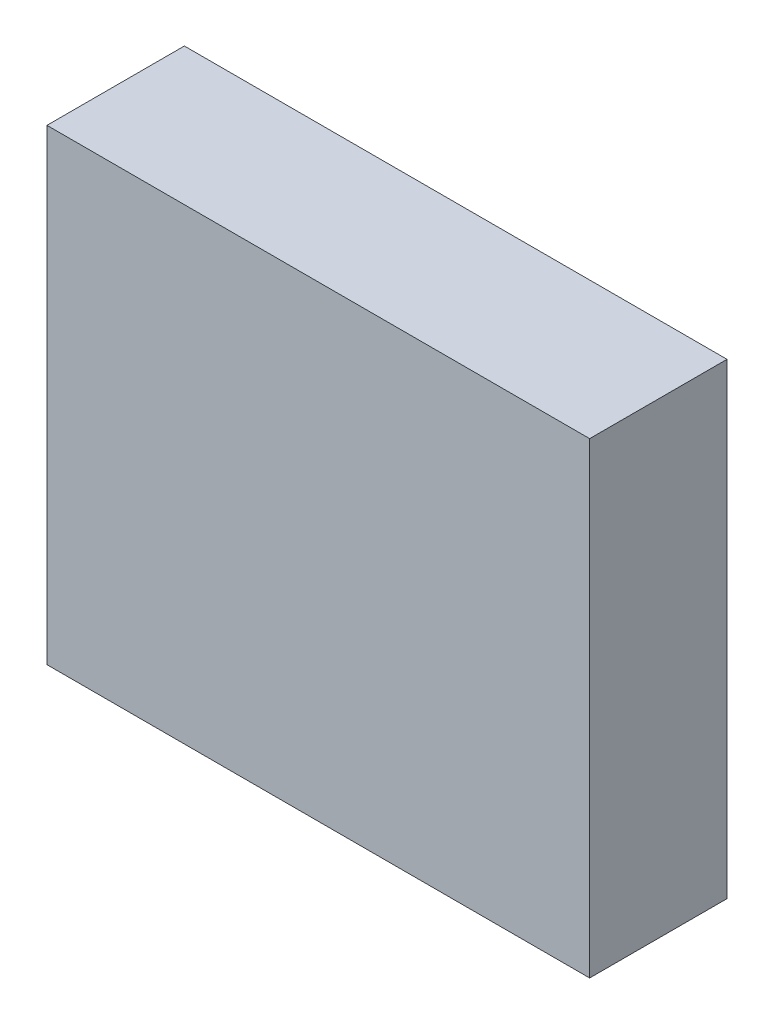
ISO-10303-21;
HEADER;
FILE_DESCRIPTION(('STEP AP214'),'2;1');
FILE_NAME('part.step','',(''),(''),'','','');
FILE_SCHEMA(('AUTOMOTIVE_DESIGN { 1 0 10303 214 1 1 1 1 }'));
ENDSEC;
DATA;
#1=APPLICATION_CONTEXT('core data for automotive mechanical design processes');
#2=APPLICATION_PROTOCOL_DEFINITION('international standard','automotive_design',2000,#1);
#3=PRODUCT_CONTEXT('',#1,'mechanical');
#4=PRODUCT('Part','Part','',(#3));
#5=PRODUCT_RELATED_PRODUCT_CATEGORY('part','',(#4));
#6=PRODUCT_DEFINITION_FORMATION('','',#4);
#7=PRODUCT_DEFINITION_CONTEXT('part definition',#1,'design');
#8=PRODUCT_DEFINITION('design','',#6,#7);
#9=PRODUCT_DEFINITION_SHAPE('','',#8);
#10=(LENGTH_UNIT() NAMED_UNIT(*) SI_UNIT(.MILLI.,.METRE.));
#11=(NAMED_UNIT(*) PLANE_ANGLE_UNIT() SI_UNIT($,.RADIAN.));
#12=(NAMED_UNIT(*) SI_UNIT($,.STERADIAN.) SOLID_ANGLE_UNIT());
#13=UNCERTAINTY_MEASURE_WITH_UNIT(LENGTH_MEASURE(1.E-05),#10,'distance_accuracy_value','');
#14=(GEOMETRIC_REPRESENTATION_CONTEXT(3) GLOBAL_UNCERTAINTY_ASSIGNED_CONTEXT((#13)) GLOBAL_UNIT_ASSIGNED_CONTEXT((#10,
#11,#12)) REPRESENTATION_CONTEXT('',''));
#15=CARTESIAN_POINT('',(0.,0.,0.));
#16=DIRECTION('',(0.,0.,1.));
#17=DIRECTION('',(1.,0.,0.));
#18=AXIS2_PLACEMENT_3D('',#15,#16,#17);
#19=CARTESIAN_POINT('',(39.5,-34.,20.));
#20=DIRECTION('',(-1.,0.,0.));
#21=DIRECTION('',(0.,0.,1.));
#22=AXIS2_PLACEMENT_3D('',#19,#20,#21);
#23=PLANE('',#22);
#24=DIRECTION('',(0.,1.,0.));
#25=VECTOR('',#24,1.);
#26=CARTESIAN_POINT('',(39.5,-34.,0.));
#27=LINE('',#26,#25);
#28=CARTESIAN_POINT('',(39.5,-34.,0.));
#29=VERTEX_POINT('',#28);
#30=CARTESIAN_POINT('',(39.5,34.,0.));
#31=VERTEX_POINT('',#30);
#32=EDGE_CURVE('E144',#29,#31,#27,.T.);
#33=ORIENTED_EDGE('',*,*,#32,.T.);
#34=DIRECTION('',(0.,0.,-1.));
#35=VECTOR('',#34,1.);
#36=CARTESIAN_POINT('',(39.5,34.,20.));
#37=LINE('',#36,#35);
#38=CARTESIAN_POINT('',(39.5,34.,20.));
#39=VERTEX_POINT('',#38);
#40=EDGE_CURVE('E11',#39,#31,#37,.T.);
#41=ORIENTED_EDGE('',*,*,#40,.F.);
#42=DIRECTION('',(0.,1.,0.));
#43=VECTOR('',#42,1.);
#44=CARTESIAN_POINT('',(39.5,-34.,20.));
#45=LINE('',#44,#43);
#46=CARTESIAN_POINT('',(39.5,-34.,20.));
#47=VERTEX_POINT('',#46);
#48=EDGE_CURVE('E148',#47,#39,#45,.T.);
#49=ORIENTED_EDGE('',*,*,#48,.F.);
#50=DIRECTION('',(0.,0.,-1.));
#51=VECTOR('',#50,1.);
#52=CARTESIAN_POINT('',(39.5,-34.,20.));
#53=LINE('',#52,#51);
#54=EDGE_CURVE('E154',#47,#29,#53,.T.);
#55=ORIENTED_EDGE('',*,*,#54,.T.);
#56=EDGE_LOOP('',(#33,#41,#49,#55));
#57=FACE_BOUND('',#56,.T.);
#58=ADVANCED_FACE('F33',(#57),#23,.F.);
#59=CARTESIAN_POINT('',(-39.5,34.,20.));
#60=DIRECTION('',(0.,-1.,0.));
#61=DIRECTION('',(0.,0.,-1.));
#62=AXIS2_PLACEMENT_3D('',#59,#60,#61);
#63=PLANE('',#62);
#64=DIRECTION('',(-1.,0.,0.));
#65=VECTOR('',#64,1.);
#66=CARTESIAN_POINT('',(-39.5,34.,0.));
#67=LINE('',#66,#65);
#68=CARTESIAN_POINT('',(-39.5,34.,0.));
#69=VERTEX_POINT('',#68);
#70=EDGE_CURVE('E157',#31,#69,#67,.T.);
#71=ORIENTED_EDGE('',*,*,#70,.T.);
#72=DIRECTION('',(0.,0.,-1.));
#73=VECTOR('',#72,1.);
#74=CARTESIAN_POINT('',(-39.5,34.,20.));
#75=LINE('',#74,#73);
#76=CARTESIAN_POINT('',(-39.5,34.,20.));
#77=VERTEX_POINT('',#76);
#78=EDGE_CURVE('E41',#77,#69,#75,.T.);
#79=ORIENTED_EDGE('',*,*,#78,.F.);
#80=DIRECTION('',(-1.,0.,0.));
#81=VECTOR('',#80,1.);
#82=CARTESIAN_POINT('',(-39.5,34.,20.));
#83=LINE('',#82,#81);
#84=EDGE_CURVE('E86',#39,#77,#83,.T.);
#85=ORIENTED_EDGE('',*,*,#84,.F.);
#86=ORIENTED_EDGE('',*,*,#40,.T.);
#87=EDGE_LOOP('',(#71,#79,#85,#86));
#88=FACE_BOUND('',#87,.T.);
#89=ADVANCED_FACE('F304',(#88),#63,.F.);
#90=CARTESIAN_POINT('',(-39.5,-34.,20.));
#91=DIRECTION('',(1.,0.,0.));
#92=DIRECTION('',(0.,0.,-1.));
#93=AXIS2_PLACEMENT_3D('',#90,#91,#92);
#94=PLANE('',#93);
#95=DIRECTION('',(0.,-1.,0.));
#96=VECTOR('',#95,1.);
#97=CARTESIAN_POINT('',(-39.5,-34.,0.));
#98=LINE('',#97,#96);
#99=CARTESIAN_POINT('',(-39.5,-34.,0.));
#100=VERTEX_POINT('',#99);
#101=EDGE_CURVE('E159',#69,#100,#98,.T.);
#102=ORIENTED_EDGE('',*,*,#101,.T.);
#103=DIRECTION('',(0.,0.,-1.));
#104=VECTOR('',#103,1.);
#105=CARTESIAN_POINT('',(-39.5,-34.,20.));
#106=LINE('',#105,#104);
#107=CARTESIAN_POINT('',(-39.5,-34.,20.));
#108=VERTEX_POINT('',#107);
#109=EDGE_CURVE('E163',#108,#100,#106,.T.);
#110=ORIENTED_EDGE('',*,*,#109,.F.);
#111=DIRECTION('',(0.,-1.,0.));
#112=VECTOR('',#111,1.);
#113=CARTESIAN_POINT('',(-39.5,-34.,20.));
#114=LINE('',#113,#112);
#115=EDGE_CURVE('E151',#77,#108,#114,.T.);
#116=ORIENTED_EDGE('',*,*,#115,.F.);
#117=ORIENTED_EDGE('',*,*,#78,.T.);
#118=EDGE_LOOP('',(#102,#110,#116,#117));
#119=FACE_BOUND('',#118,.T.);
#120=ADVANCED_FACE('F309',(#119),#94,.F.);
#121=CARTESIAN_POINT('',(-39.5,-34.,20.));
#122=DIRECTION('',(0.,1.,0.));
#123=DIRECTION('',(0.,0.,1.));
#124=AXIS2_PLACEMENT_3D('',#121,#122,#123);
#125=PLANE('',#124);
#126=DIRECTION('',(1.,0.,0.));
#127=VECTOR('',#126,1.);
#128=CARTESIAN_POINT('',(-39.5,-34.,0.));
#129=LINE('',#128,#127);
#130=EDGE_CURVE('E79',#100,#29,#129,.T.);
#131=ORIENTED_EDGE('',*,*,#130,.T.);
#132=ORIENTED_EDGE('',*,*,#54,.F.);
#133=DIRECTION('',(1.,0.,0.));
#134=VECTOR('',#133,1.);
#135=CARTESIAN_POINT('',(-39.5,-34.,20.));
#136=LINE('',#135,#134);
#137=EDGE_CURVE('E58',#108,#47,#136,.T.);
#138=ORIENTED_EDGE('',*,*,#137,.F.);
#139=ORIENTED_EDGE('',*,*,#109,.T.);
#140=EDGE_LOOP('',(#131,#132,#138,#139));
#141=FACE_BOUND('',#140,.T.);
#142=ADVANCED_FACE('F321',(#141),#125,.F.);
#143=CARTESIAN_POINT('',(0.,0.,20.));
#144=DIRECTION('',(0.,0.,-1.));
#145=DIRECTION('',(-1.,0.,0.));
#146=AXIS2_PLACEMENT_3D('',#143,#144,#145);
#147=PLANE('',#146);
#148=ORIENTED_EDGE('',*,*,#48,.T.);
#149=ORIENTED_EDGE('',*,*,#84,.T.);
#150=ORIENTED_EDGE('',*,*,#115,.T.);
#151=ORIENTED_EDGE('',*,*,#137,.T.);
#152=EDGE_LOOP('',(#148,#149,#150,#151));
#153=FACE_BOUND('',#152,.T.);
#154=ADVANCED_FACE('F319',(#153),#147,.F.);
#155=CARTESIAN_POINT('',(0.,0.,0.));
#156=DIRECTION('',(0.,0.,-1.));
#157=DIRECTION('',(-1.,0.,0.));
#158=AXIS2_PLACEMENT_3D('',#155,#156,#157);
#159=PLANE('',#158);
#160=DIRECTION('',(0.,1.,0.));
#161=VECTOR('',#160,1.);
#162=CARTESIAN_POINT('',(-34.5,-29.,0.));
#163=LINE('',#162,#161);
#164=CARTESIAN_POINT('',(-34.5,-29.,0.));
#165=VERTEX_POINT('',#164);
#166=CARTESIAN_POINT('',(-34.5,29.,0.));
#167=VERTEX_POINT('',#166);
#168=EDGE_CURVE('E49',#165,#167,#163,.T.);
#169=ORIENTED_EDGE('',*,*,#168,.F.);
#170=DIRECTION('',(-1.,0.,0.));
#171=VECTOR('',#170,1.);
#172=CARTESIAN_POINT('',(34.5,-29.,0.));
#173=LINE('',#172,#171);
#174=CARTESIAN_POINT('',(34.5,-29.,0.));
#175=VERTEX_POINT('',#174);
#176=EDGE_CURVE('E128',#175,#165,#173,.T.);
#177=ORIENTED_EDGE('',*,*,#176,.F.);
#178=DIRECTION('',(0.,-1.,0.));
#179=VECTOR('',#178,1.);
#180=CARTESIAN_POINT('',(34.5,-29.,0.));
#181=LINE('',#180,#179);
#182=CARTESIAN_POINT('',(34.5,29.,0.));
#183=VERTEX_POINT('',#182);
#184=EDGE_CURVE('E131',#183,#175,#181,.T.);
#185=ORIENTED_EDGE('',*,*,#184,.F.);
#186=DIRECTION('',(1.,0.,0.));
#187=VECTOR('',#186,1.);
#188=CARTESIAN_POINT('',(34.5,29.,0.));
#189=LINE('',#188,#187);
#190=EDGE_CURVE('E137',#167,#183,#189,.T.);
#191=ORIENTED_EDGE('',*,*,#190,.F.);
#192=EDGE_LOOP('',(#169,#177,#185,#191));
#193=FACE_BOUND('',#192,.T.);
#194=ORIENTED_EDGE('',*,*,#32,.F.);
#195=ORIENTED_EDGE('',*,*,#130,.F.);
#196=ORIENTED_EDGE('',*,*,#101,.F.);
#197=ORIENTED_EDGE('',*,*,#70,.F.);
#198=EDGE_LOOP('',(#194,#195,#196,#197));
#199=FACE_BOUND('',#198,.T.);
#200=ADVANCED_FACE('F314',(#193,#199),#159,.T.);
#201=CARTESIAN_POINT('',(-34.5,-29.,10.));
#202=DIRECTION('',(-1.,0.,0.));
#203=DIRECTION('',(0.,0.,1.));
#204=AXIS2_PLACEMENT_3D('',#201,#202,#203);
#205=PLANE('',#204);
#206=ORIENTED_EDGE('',*,*,#168,.T.);
#207=DIRECTION('',(0.,0.,-1.));
#208=VECTOR('',#207,1.);
#209=CARTESIAN_POINT('',(-34.5,29.,10.));
#210=LINE('',#209,#208);
#211=CARTESIAN_POINT('',(-34.5,29.,10.));
#212=VERTEX_POINT('',#211);
#213=EDGE_CURVE('E106',#212,#167,#210,.T.);
#214=ORIENTED_EDGE('',*,*,#213,.F.);
#215=DIRECTION('',(0.,1.,0.));
#216=VECTOR('',#215,1.);
#217=CARTESIAN_POINT('',(-34.5,-29.,10.));
#218=LINE('',#217,#216);
#219=CARTESIAN_POINT('',(-34.5,-29.,10.));
#220=VERTEX_POINT('',#219);
#221=EDGE_CURVE('E110',#220,#212,#218,.T.);
#222=ORIENTED_EDGE('',*,*,#221,.F.);
#223=DIRECTION('',(0.,0.,-1.));
#224=VECTOR('',#223,1.);
#225=CARTESIAN_POINT('',(-34.5,-29.,10.));
#226=LINE('',#225,#224);
#227=EDGE_CURVE('E142',#220,#165,#226,.T.);
#228=ORIENTED_EDGE('',*,*,#227,.T.);
#229=EDGE_LOOP('',(#206,#214,#222,#228));
#230=FACE_BOUND('',#229,.T.);
#231=ADVANCED_FACE('F108',(#230),#205,.F.);
#232=CARTESIAN_POINT('',(34.5,-29.,10.));
#233=DIRECTION('',(0.,-1.,0.));
#234=DIRECTION('',(1.,0.,0.));
#235=AXIS2_PLACEMENT_3D('',#232,#233,#234);
#236=PLANE('',#235);
#237=ORIENTED_EDGE('',*,*,#176,.T.);
#238=ORIENTED_EDGE('',*,*,#227,.F.);
#239=DIRECTION('',(-1.,0.,0.));
#240=VECTOR('',#239,1.);
#241=CARTESIAN_POINT('',(34.5,-29.,10.));
#242=LINE('',#241,#240);
#243=CARTESIAN_POINT('',(34.5,-29.,10.));
#244=VERTEX_POINT('',#243);
#245=EDGE_CURVE('E116',#244,#220,#242,.T.);
#246=ORIENTED_EDGE('',*,*,#245,.F.);
#247=DIRECTION('',(0.,0.,-1.));
#248=VECTOR('',#247,1.);
#249=CARTESIAN_POINT('',(34.5,-29.,10.));
#250=LINE('',#249,#248);
#251=EDGE_CURVE('E145',#244,#175,#250,.T.);
#252=ORIENTED_EDGE('',*,*,#251,.T.);
#253=EDGE_LOOP('',(#237,#238,#246,#252));
#254=FACE_BOUND('',#253,.T.);
#255=ADVANCED_FACE('F361',(#254),#236,.F.);
#256=CARTESIAN_POINT('',(34.5,-29.,10.));
#257=DIRECTION('',(1.,0.,0.));
#258=DIRECTION('',(0.,1.,0.));
#259=AXIS2_PLACEMENT_3D('',#256,#257,#258);
#260=PLANE('',#259);
#261=ORIENTED_EDGE('',*,*,#184,.T.);
#262=ORIENTED_EDGE('',*,*,#251,.F.);
#263=DIRECTION('',(0.,-1.,0.));
#264=VECTOR('',#263,1.);
#265=CARTESIAN_POINT('',(34.5,-29.,10.));
#266=LINE('',#265,#264);
#267=CARTESIAN_POINT('',(34.5,29.,10.));
#268=VERTEX_POINT('',#267);
#269=EDGE_CURVE('E124',#268,#244,#266,.T.);
#270=ORIENTED_EDGE('',*,*,#269,.F.);
#271=DIRECTION('',(0.,0.,-1.));
#272=VECTOR('',#271,1.);
#273=CARTESIAN_POINT('',(34.5,29.,10.));
#274=LINE('',#273,#272);
#275=EDGE_CURVE('E115',#268,#183,#274,.T.);
#276=ORIENTED_EDGE('',*,*,#275,.T.);
#277=EDGE_LOOP('',(#261,#262,#270,#276));
#278=FACE_BOUND('',#277,.T.);
#279=ADVANCED_FACE('F369',(#278),#260,.F.);
#280=CARTESIAN_POINT('',(34.5,29.,10.));
#281=DIRECTION('',(0.,1.,0.));
#282=DIRECTION('',(-1.,0.,0.));
#283=AXIS2_PLACEMENT_3D('',#280,#281,#282);
#284=PLANE('',#283);
#285=ORIENTED_EDGE('',*,*,#190,.T.);
#286=ORIENTED_EDGE('',*,*,#275,.F.);
#287=DIRECTION('',(1.,0.,0.));
#288=VECTOR('',#287,1.);
#289=CARTESIAN_POINT('',(34.5,29.,10.));
#290=LINE('',#289,#288);
#291=EDGE_CURVE('E119',#212,#268,#290,.T.);
#292=ORIENTED_EDGE('',*,*,#291,.F.);
#293=ORIENTED_EDGE('',*,*,#213,.T.);
#294=EDGE_LOOP('',(#285,#286,#292,#293));
#295=FACE_BOUND('',#294,.T.);
#296=ADVANCED_FACE('F120',(#295),#284,.F.);
#297=CARTESIAN_POINT('',(0.,0.,10.));
#298=DIRECTION('',(0.,0.,1.));
#299=DIRECTION('',(1.,0.,0.));
#300=AXIS2_PLACEMENT_3D('',#297,#298,#299);
#301=PLANE('',#300);
#302=CARTESIAN_POINT('',(20.,-20.,10.));
#303=DIRECTION('',(0.,0.,1.));
#304=DIRECTION('',(1.,0.,0.));
#305=AXIS2_PLACEMENT_3D('',#302,#303,#304);
#306=CIRCLE('',#305,2.5);
#307=CARTESIAN_POINT('',(22.5,-20.,10.));
#308=VERTEX_POINT('',#307);
#309=EDGE_CURVE('E36',#308,#308,#306,.F.);
#310=ORIENTED_EDGE('',*,*,#309,.F.);
#311=EDGE_LOOP('',(#310));
#312=FACE_BOUND('',#311,.T.);
#313=CARTESIAN_POINT('',(20.,-10.,10.));
#314=DIRECTION('',(0.,0.,1.));
#315=DIRECTION('',(1.,0.,0.));
#316=AXIS2_PLACEMENT_3D('',#313,#314,#315);
#317=CIRCLE('',#316,2.5);
#318=CARTESIAN_POINT('',(22.5,-10.,10.));
#319=VERTEX_POINT('',#318);
#320=EDGE_CURVE('E234',#319,#319,#317,.F.);
#321=ORIENTED_EDGE('',*,*,#320,.F.);
#322=EDGE_LOOP('',(#321));
#323=FACE_BOUND('',#322,.T.);
#324=CARTESIAN_POINT('',(20.,20.,10.));
#325=DIRECTION('',(0.,0.,1.));
#326=DIRECTION('',(1.,0.,0.));
#327=AXIS2_PLACEMENT_3D('',#324,#325,#326);
#328=CIRCLE('',#327,2.5);
#329=CARTESIAN_POINT('',(22.5,20.,10.));
#330=VERTEX_POINT('',#329);
#331=EDGE_CURVE('E232',#330,#330,#328,.F.);
#332=ORIENTED_EDGE('',*,*,#331,.F.);
#333=EDGE_LOOP('',(#332));
#334=FACE_BOUND('',#333,.T.);
#335=CARTESIAN_POINT('',(20.,10.,10.));
#336=DIRECTION('',(0.,0.,1.));
#337=DIRECTION('',(1.,0.,0.));
#338=AXIS2_PLACEMENT_3D('',#335,#336,#337);
#339=CIRCLE('',#338,2.5);
#340=CARTESIAN_POINT('',(22.5,10.,10.));
#341=VERTEX_POINT('',#340);
#342=EDGE_CURVE('E229',#341,#341,#339,.F.);
#343=ORIENTED_EDGE('',*,*,#342,.F.);
#344=EDGE_LOOP('',(#343));
#345=FACE_BOUND('',#344,.T.);
#346=CARTESIAN_POINT('',(20.,0.,10.));
#347=DIRECTION('',(0.,0.,1.));
#348=DIRECTION('',(1.,0.,0.));
#349=AXIS2_PLACEMENT_3D('',#346,#347,#348);
#350=CIRCLE('',#349,2.5);
#351=CARTESIAN_POINT('',(22.5,0.,10.));
#352=VERTEX_POINT('',#351);
#353=EDGE_CURVE('E226',#352,#352,#350,.F.);
#354=ORIENTED_EDGE('',*,*,#353,.F.);
#355=EDGE_LOOP('',(#354));
#356=FACE_BOUND('',#355,.T.);
#357=CARTESIAN_POINT('',(10.,-20.,10.));
#358=DIRECTION('',(0.,0.,1.));
#359=DIRECTION('',(1.,0.,0.));
#360=AXIS2_PLACEMENT_3D('',#357,#358,#359);
#361=CIRCLE('',#360,2.5);
#362=CARTESIAN_POINT('',(12.5,-20.,10.));
#363=VERTEX_POINT('',#362);
#364=EDGE_CURVE('E223',#363,#363,#361,.F.);
#365=ORIENTED_EDGE('',*,*,#364,.F.);
#366=EDGE_LOOP('',(#365));
#367=FACE_BOUND('',#366,.T.);
#368=CARTESIAN_POINT('',(10.,-10.,10.));
#369=DIRECTION('',(0.,0.,1.));
#370=DIRECTION('',(1.,0.,0.));
#371=AXIS2_PLACEMENT_3D('',#368,#369,#370);
#372=CIRCLE('',#371,2.5);
#373=CARTESIAN_POINT('',(12.5,-10.,10.));
#374=VERTEX_POINT('',#373);
#375=EDGE_CURVE('E220',#374,#374,#372,.F.);
#376=ORIENTED_EDGE('',*,*,#375,.F.);
#377=EDGE_LOOP('',(#376));
#378=FACE_BOUND('',#377,.T.);
#379=CARTESIAN_POINT('',(10.,20.,10.));
#380=DIRECTION('',(0.,0.,1.));
#381=DIRECTION('',(1.,0.,0.));
#382=AXIS2_PLACEMENT_3D('',#379,#380,#381);
#383=CIRCLE('',#382,2.5);
#384=CARTESIAN_POINT('',(12.5,20.,10.));
#385=VERTEX_POINT('',#384);
#386=EDGE_CURVE('E217',#385,#385,#383,.F.);
#387=ORIENTED_EDGE('',*,*,#386,.F.);
#388=EDGE_LOOP('',(#387));
#389=FACE_BOUND('',#388,.T.);
#390=CARTESIAN_POINT('',(10.,10.,10.));
#391=DIRECTION('',(0.,0.,1.));
#392=DIRECTION('',(1.,0.,0.));
#393=AXIS2_PLACEMENT_3D('',#390,#391,#392);
#394=CIRCLE('',#393,2.5);
#395=CARTESIAN_POINT('',(12.5,10.,10.));
#396=VERTEX_POINT('',#395);
#397=EDGE_CURVE('E214',#396,#396,#394,.F.);
#398=ORIENTED_EDGE('',*,*,#397,.F.);
#399=EDGE_LOOP('',(#398));
#400=FACE_BOUND('',#399,.T.);
#401=CARTESIAN_POINT('',(10.,0.,10.));
#402=DIRECTION('',(0.,0.,1.));
#403=DIRECTION('',(1.,0.,0.));
#404=AXIS2_PLACEMENT_3D('',#401,#402,#403);
#405=CIRCLE('',#404,2.5);
#406=CARTESIAN_POINT('',(12.5,0.,10.));
#407=VERTEX_POINT('',#406);
#408=EDGE_CURVE('E211',#407,#407,#405,.F.);
#409=ORIENTED_EDGE('',*,*,#408,.F.);
#410=EDGE_LOOP('',(#409));
#411=FACE_BOUND('',#410,.T.);
#412=CARTESIAN_POINT('',(-20.,-20.,10.));
#413=DIRECTION('',(0.,0.,1.));
#414=DIRECTION('',(1.,0.,0.));
#415=AXIS2_PLACEMENT_3D('',#412,#413,#414);
#416=CIRCLE('',#415,2.5);
#417=CARTESIAN_POINT('',(-17.5,-20.,10.));
#418=VERTEX_POINT('',#417);
#419=EDGE_CURVE('E208',#418,#418,#416,.F.);
#420=ORIENTED_EDGE('',*,*,#419,.F.);
#421=EDGE_LOOP('',(#420));
#422=FACE_BOUND('',#421,.T.);
#423=CARTESIAN_POINT('',(-10.,-20.,10.));
#424=DIRECTION('',(0.,0.,1.));
#425=DIRECTION('',(1.,0.,0.));
#426=AXIS2_PLACEMENT_3D('',#423,#424,#425);
#427=CIRCLE('',#426,2.5);
#428=CARTESIAN_POINT('',(-7.5,-20.,10.));
#429=VERTEX_POINT('',#428);
#430=EDGE_CURVE('E205',#429,#429,#427,.F.);
#431=ORIENTED_EDGE('',*,*,#430,.F.);
#432=EDGE_LOOP('',(#431));
#433=FACE_BOUND('',#432,.T.);
#434=CARTESIAN_POINT('',(0.,-20.,10.));
#435=DIRECTION('',(0.,0.,1.));
#436=DIRECTION('',(1.,0.,0.));
#437=AXIS2_PLACEMENT_3D('',#434,#435,#436);
#438=CIRCLE('',#437,2.5);
#439=CARTESIAN_POINT('',(2.5,-20.,10.));
#440=VERTEX_POINT('',#439);
#441=EDGE_CURVE('E202',#440,#440,#438,.F.);
#442=ORIENTED_EDGE('',*,*,#441,.F.);
#443=EDGE_LOOP('',(#442));
#444=FACE_BOUND('',#443,.T.);
#445=CARTESIAN_POINT('',(-20.,-10.,10.));
#446=DIRECTION('',(0.,0.,1.));
#447=DIRECTION('',(1.,0.,0.));
#448=AXIS2_PLACEMENT_3D('',#445,#446,#447);
#449=CIRCLE('',#448,2.5);
#450=CARTESIAN_POINT('',(-17.5,-10.,10.));
#451=VERTEX_POINT('',#450);
#452=EDGE_CURVE('E199',#451,#451,#449,.F.);
#453=ORIENTED_EDGE('',*,*,#452,.F.);
#454=EDGE_LOOP('',(#453));
#455=FACE_BOUND('',#454,.T.);
#456=CARTESIAN_POINT('',(-10.,-10.,10.));
#457=DIRECTION('',(0.,0.,1.));
#458=DIRECTION('',(1.,0.,0.));
#459=AXIS2_PLACEMENT_3D('',#456,#457,#458);
#460=CIRCLE('',#459,2.5);
#461=CARTESIAN_POINT('',(-7.5,-10.,10.));
#462=VERTEX_POINT('',#461);
#463=EDGE_CURVE('E196',#462,#462,#460,.F.);
#464=ORIENTED_EDGE('',*,*,#463,.F.);
#465=EDGE_LOOP('',(#464));
#466=FACE_BOUND('',#465,.T.);
#467=CARTESIAN_POINT('',(0.,-10.,10.));
#468=DIRECTION('',(0.,0.,1.));
#469=DIRECTION('',(1.,0.,0.));
#470=AXIS2_PLACEMENT_3D('',#467,#468,#469);
#471=CIRCLE('',#470,2.5);
#472=CARTESIAN_POINT('',(2.5,-10.,10.));
#473=VERTEX_POINT('',#472);
#474=EDGE_CURVE('E193',#473,#473,#471,.F.);
#475=ORIENTED_EDGE('',*,*,#474,.F.);
#476=EDGE_LOOP('',(#475));
#477=FACE_BOUND('',#476,.T.);
#478=CARTESIAN_POINT('',(-20.,20.,10.));
#479=DIRECTION('',(0.,0.,1.));
#480=DIRECTION('',(1.,0.,0.));
#481=AXIS2_PLACEMENT_3D('',#478,#479,#480);
#482=CIRCLE('',#481,2.5);
#483=CARTESIAN_POINT('',(-17.5,20.,10.));
#484=VERTEX_POINT('',#483);
#485=EDGE_CURVE('E190',#484,#484,#482,.F.);
#486=ORIENTED_EDGE('',*,*,#485,.F.);
#487=EDGE_LOOP('',(#486));
#488=FACE_BOUND('',#487,.T.);
#489=CARTESIAN_POINT('',(-10.,20.,10.));
#490=DIRECTION('',(0.,0.,1.));
#491=DIRECTION('',(1.,0.,0.));
#492=AXIS2_PLACEMENT_3D('',#489,#490,#491);
#493=CIRCLE('',#492,2.5);
#494=CARTESIAN_POINT('',(-7.5,20.,10.));
#495=VERTEX_POINT('',#494);
#496=EDGE_CURVE('E187',#495,#495,#493,.F.);
#497=ORIENTED_EDGE('',*,*,#496,.F.);
#498=EDGE_LOOP('',(#497));
#499=FACE_BOUND('',#498,.T.);
#500=CARTESIAN_POINT('',(0.,20.,10.));
#501=DIRECTION('',(0.,0.,1.));
#502=DIRECTION('',(1.,0.,0.));
#503=AXIS2_PLACEMENT_3D('',#500,#501,#502);
#504=CIRCLE('',#503,2.5);
#505=CARTESIAN_POINT('',(2.5,20.,10.));
#506=VERTEX_POINT('',#505);
#507=EDGE_CURVE('E184',#506,#506,#504,.F.);
#508=ORIENTED_EDGE('',*,*,#507,.F.);
#509=EDGE_LOOP('',(#508));
#510=FACE_BOUND('',#509,.T.);
#511=CARTESIAN_POINT('',(-20.,10.,10.));
#512=DIRECTION('',(0.,0.,1.));
#513=DIRECTION('',(1.,0.,0.));
#514=AXIS2_PLACEMENT_3D('',#511,#512,#513);
#515=CIRCLE('',#514,2.5);
#516=CARTESIAN_POINT('',(-17.5,10.,10.));
#517=VERTEX_POINT('',#516);
#518=EDGE_CURVE('E181',#517,#517,#515,.F.);
#519=ORIENTED_EDGE('',*,*,#518,.F.);
#520=EDGE_LOOP('',(#519));
#521=FACE_BOUND('',#520,.T.);
#522=CARTESIAN_POINT('',(-10.,10.,10.));
#523=DIRECTION('',(0.,0.,1.));
#524=DIRECTION('',(1.,0.,0.));
#525=AXIS2_PLACEMENT_3D('',#522,#523,#524);
#526=CIRCLE('',#525,2.5);
#527=CARTESIAN_POINT('',(-7.5,10.,10.));
#528=VERTEX_POINT('',#527);
#529=EDGE_CURVE('E178',#528,#528,#526,.F.);
#530=ORIENTED_EDGE('',*,*,#529,.F.);
#531=EDGE_LOOP('',(#530));
#532=FACE_BOUND('',#531,.T.);
#533=CARTESIAN_POINT('',(0.,10.,10.));
#534=DIRECTION('',(0.,0.,1.));
#535=DIRECTION('',(1.,0.,0.));
#536=AXIS2_PLACEMENT_3D('',#533,#534,#535);
#537=CIRCLE('',#536,2.5);
#538=CARTESIAN_POINT('',(2.5,10.,10.));
#539=VERTEX_POINT('',#538);
#540=EDGE_CURVE('E175',#539,#539,#537,.F.);
#541=ORIENTED_EDGE('',*,*,#540,.F.);
#542=EDGE_LOOP('',(#541));
#543=FACE_BOUND('',#542,.T.);
#544=CARTESIAN_POINT('',(-20.,0.,10.));
#545=DIRECTION('',(0.,0.,1.));
#546=DIRECTION('',(1.,0.,0.));
#547=AXIS2_PLACEMENT_3D('',#544,#545,#546);
#548=CIRCLE('',#547,2.5);
#549=CARTESIAN_POINT('',(-17.5,0.,10.));
#550=VERTEX_POINT('',#549);
#551=EDGE_CURVE('E172',#550,#550,#548,.F.);
#552=ORIENTED_EDGE('',*,*,#551,.F.);
#553=EDGE_LOOP('',(#552));
#554=FACE_BOUND('',#553,.T.);
#555=CARTESIAN_POINT('',(-10.,0.,10.));
#556=DIRECTION('',(0.,0.,1.));
#557=DIRECTION('',(1.,0.,0.));
#558=AXIS2_PLACEMENT_3D('',#555,#556,#557);
#559=CIRCLE('',#558,2.5);
#560=CARTESIAN_POINT('',(-7.5,0.,10.));
#561=VERTEX_POINT('',#560);
#562=EDGE_CURVE('E169',#561,#561,#559,.F.);
#563=ORIENTED_EDGE('',*,*,#562,.F.);
#564=EDGE_LOOP('',(#563));
#565=FACE_BOUND('',#564,.T.);
#566=CARTESIAN_POINT('',(0.,0.,10.));
#567=DIRECTION('',(0.,0.,1.));
#568=DIRECTION('',(1.,0.,0.));
#569=AXIS2_PLACEMENT_3D('',#566,#567,#568);
#570=CIRCLE('',#569,2.5);
#571=CARTESIAN_POINT('',(2.5,0.,10.));
#572=VERTEX_POINT('',#571);
#573=EDGE_CURVE('E138',#572,#572,#570,.F.);
#574=ORIENTED_EDGE('',*,*,#573,.F.);
#575=EDGE_LOOP('',(#574));
#576=FACE_BOUND('',#575,.T.);
#577=ORIENTED_EDGE('',*,*,#221,.T.);
#578=ORIENTED_EDGE('',*,*,#291,.T.);
#579=ORIENTED_EDGE('',*,*,#269,.T.);
#580=ORIENTED_EDGE('',*,*,#245,.T.);
#581=EDGE_LOOP('',(#577,#578,#579,#580));
#582=FACE_BOUND('',#581,.T.);
#583=ADVANCED_FACE('F126',(#312,#323,#334,#345,#356,#367,#378,#389,#400,#411,#422,#433,#444,
#455,#466,#477,#488,#499,#510,#521,#532,#543,#554,#565,#576,#582),#301,.F.);
#584=CARTESIAN_POINT('',(0.,0.,10.));
#585=DIRECTION('',(0.,1.,0.));
#586=DIRECTION('',(-1.,0.,0.));
#587=AXIS2_PLACEMENT_3D('',#584,#585,#586);
#588=SPHERICAL_SURFACE('',#587,2.5);
#589=CARTESIAN_POINT('',(0.,0.,10.));
#590=DIRECTION('',(0.,0.,1.));
#591=DIRECTION('',(1.,0.,0.));
#592=AXIS2_PLACEMENT_3D('',#589,#590,#591);
#593=SPHERICAL_SURFACE('',#592,2.5);
#594=ORIENTED_EDGE('',*,*,#573,.T.);
#595=EDGE_LOOP('',(#594));
#596=FACE_BOUND('',#595,.T.);
#597=ADVANCED_FACE('F245',(#596),#593,.F.);
#598=CARTESIAN_POINT('',(-10.,0.,10.));
#599=DIRECTION('',(0.,1.,0.));
#600=DIRECTION('',(-1.,0.,0.));
#601=AXIS2_PLACEMENT_3D('',#598,#599,#600);
#602=SPHERICAL_SURFACE('',#601,2.5);
#603=CARTESIAN_POINT('',(-10.,0.,10.));
#604=DIRECTION('',(0.,0.,1.));
#605=DIRECTION('',(1.,0.,0.));
#606=AXIS2_PLACEMENT_3D('',#603,#604,#605);
#607=SPHERICAL_SURFACE('',#606,2.5);
#608=ORIENTED_EDGE('',*,*,#562,.T.);
#609=EDGE_LOOP('',(#608));
#610=FACE_BOUND('',#609,.T.);
#611=ADVANCED_FACE('F295',(#610),#607,.F.);
#612=CARTESIAN_POINT('',(-20.,0.,10.));
#613=DIRECTION('',(0.,1.,0.));
#614=DIRECTION('',(-1.,0.,0.));
#615=AXIS2_PLACEMENT_3D('',#612,#613,#614);
#616=SPHERICAL_SURFACE('',#615,2.5);
#617=CARTESIAN_POINT('',(-20.,0.,10.));
#618=DIRECTION('',(0.,0.,1.));
#619=DIRECTION('',(1.,0.,0.));
#620=AXIS2_PLACEMENT_3D('',#617,#618,#619);
#621=SPHERICAL_SURFACE('',#620,2.5);
#622=ORIENTED_EDGE('',*,*,#551,.T.);
#623=EDGE_LOOP('',(#622));
#624=FACE_BOUND('',#623,.T.);
#625=ADVANCED_FACE('F300',(#624),#621,.F.);
#626=CARTESIAN_POINT('',(0.,10.,10.));
#627=DIRECTION('',(0.,1.,0.));
#628=DIRECTION('',(-1.,0.,0.));
#629=AXIS2_PLACEMENT_3D('',#626,#627,#628);
#630=SPHERICAL_SURFACE('',#629,2.5);
#631=CARTESIAN_POINT('',(0.,10.,10.));
#632=DIRECTION('',(0.,0.,1.));
#633=DIRECTION('',(1.,0.,0.));
#634=AXIS2_PLACEMENT_3D('',#631,#632,#633);
#635=SPHERICAL_SURFACE('',#634,2.5);
#636=ORIENTED_EDGE('',*,*,#540,.T.);
#637=EDGE_LOOP('',(#636));
#638=FACE_BOUND('',#637,.T.);
#639=ADVANCED_FACE('F406',(#638),#635,.F.);
#640=CARTESIAN_POINT('',(-10.,10.,10.));
#641=DIRECTION('',(0.,1.,0.));
#642=DIRECTION('',(-1.,0.,0.));
#643=AXIS2_PLACEMENT_3D('',#640,#641,#642);
#644=SPHERICAL_SURFACE('',#643,2.5);
#645=CARTESIAN_POINT('',(-10.,10.,10.));
#646=DIRECTION('',(0.,0.,1.));
#647=DIRECTION('',(1.,0.,0.));
#648=AXIS2_PLACEMENT_3D('',#645,#646,#647);
#649=SPHERICAL_SURFACE('',#648,2.5);
#650=ORIENTED_EDGE('',*,*,#529,.T.);
#651=EDGE_LOOP('',(#650));
#652=FACE_BOUND('',#651,.T.);
#653=ADVANCED_FACE('F416',(#652),#649,.F.);
#654=CARTESIAN_POINT('',(-20.,10.,10.));
#655=DIRECTION('',(0.,1.,0.));
#656=DIRECTION('',(-1.,0.,0.));
#657=AXIS2_PLACEMENT_3D('',#654,#655,#656);
#658=SPHERICAL_SURFACE('',#657,2.5);
#659=CARTESIAN_POINT('',(-20.,10.,10.));
#660=DIRECTION('',(0.,0.,1.));
#661=DIRECTION('',(1.,0.,0.));
#662=AXIS2_PLACEMENT_3D('',#659,#660,#661);
#663=SPHERICAL_SURFACE('',#662,2.5);
#664=ORIENTED_EDGE('',*,*,#518,.T.);
#665=EDGE_LOOP('',(#664));
#666=FACE_BOUND('',#665,.T.);
#667=ADVANCED_FACE('F426',(#666),#663,.F.);
#668=CARTESIAN_POINT('',(0.,20.,10.));
#669=DIRECTION('',(0.,1.,0.));
#670=DIRECTION('',(-1.,0.,0.));
#671=AXIS2_PLACEMENT_3D('',#668,#669,#670);
#672=SPHERICAL_SURFACE('',#671,2.5);
#673=CARTESIAN_POINT('',(0.,20.,10.));
#674=DIRECTION('',(0.,0.,1.));
#675=DIRECTION('',(1.,0.,0.));
#676=AXIS2_PLACEMENT_3D('',#673,#674,#675);
#677=SPHERICAL_SURFACE('',#676,2.5);
#678=ORIENTED_EDGE('',*,*,#507,.T.);
#679=EDGE_LOOP('',(#678));
#680=FACE_BOUND('',#679,.T.);
#681=ADVANCED_FACE('F436',(#680),#677,.F.);
#682=CARTESIAN_POINT('',(-10.,20.,10.));
#683=DIRECTION('',(0.,1.,0.));
#684=DIRECTION('',(-1.,0.,0.));
#685=AXIS2_PLACEMENT_3D('',#682,#683,#684);
#686=SPHERICAL_SURFACE('',#685,2.5);
#687=CARTESIAN_POINT('',(-10.,20.,10.));
#688=DIRECTION('',(0.,0.,1.));
#689=DIRECTION('',(1.,0.,0.));
#690=AXIS2_PLACEMENT_3D('',#687,#688,#689);
#691=SPHERICAL_SURFACE('',#690,2.5);
#692=ORIENTED_EDGE('',*,*,#496,.T.);
#693=EDGE_LOOP('',(#692));
#694=FACE_BOUND('',#693,.T.);
#695=ADVANCED_FACE('F446',(#694),#691,.F.);
#696=CARTESIAN_POINT('',(-20.,20.,10.));
#697=DIRECTION('',(0.,1.,0.));
#698=DIRECTION('',(-1.,0.,0.));
#699=AXIS2_PLACEMENT_3D('',#696,#697,#698);
#700=SPHERICAL_SURFACE('',#699,2.5);
#701=CARTESIAN_POINT('',(-20.,20.,10.));
#702=DIRECTION('',(0.,0.,1.));
#703=DIRECTION('',(1.,0.,0.));
#704=AXIS2_PLACEMENT_3D('',#701,#702,#703);
#705=SPHERICAL_SURFACE('',#704,2.5);
#706=ORIENTED_EDGE('',*,*,#485,.T.);
#707=EDGE_LOOP('',(#706));
#708=FACE_BOUND('',#707,.T.);
#709=ADVANCED_FACE('F456',(#708),#705,.F.);
#710=CARTESIAN_POINT('',(0.,-10.,10.));
#711=DIRECTION('',(0.,1.,0.));
#712=DIRECTION('',(-1.,0.,0.));
#713=AXIS2_PLACEMENT_3D('',#710,#711,#712);
#714=SPHERICAL_SURFACE('',#713,2.5);
#715=CARTESIAN_POINT('',(0.,-10.,10.));
#716=DIRECTION('',(0.,0.,1.));
#717=DIRECTION('',(1.,0.,0.));
#718=AXIS2_PLACEMENT_3D('',#715,#716,#717);
#719=SPHERICAL_SURFACE('',#718,2.5);
#720=ORIENTED_EDGE('',*,*,#474,.T.);
#721=EDGE_LOOP('',(#720));
#722=FACE_BOUND('',#721,.T.);
#723=ADVANCED_FACE('F466',(#722),#719,.F.);
#724=CARTESIAN_POINT('',(-10.,-10.,10.));
#725=DIRECTION('',(0.,1.,0.));
#726=DIRECTION('',(-1.,0.,0.));
#727=AXIS2_PLACEMENT_3D('',#724,#725,#726);
#728=SPHERICAL_SURFACE('',#727,2.5);
#729=CARTESIAN_POINT('',(-10.,-10.,10.));
#730=DIRECTION('',(0.,0.,1.));
#731=DIRECTION('',(1.,0.,0.));
#732=AXIS2_PLACEMENT_3D('',#729,#730,#731);
#733=SPHERICAL_SURFACE('',#732,2.5);
#734=ORIENTED_EDGE('',*,*,#463,.T.);
#735=EDGE_LOOP('',(#734));
#736=FACE_BOUND('',#735,.T.);
#737=ADVANCED_FACE('F481',(#736),#733,.F.);
#738=CARTESIAN_POINT('',(-20.,-10.,10.));
#739=DIRECTION('',(0.,1.,0.));
#740=DIRECTION('',(-1.,0.,0.));
#741=AXIS2_PLACEMENT_3D('',#738,#739,#740);
#742=SPHERICAL_SURFACE('',#741,2.5);
#743=CARTESIAN_POINT('',(-20.,-10.,10.));
#744=DIRECTION('',(0.,0.,1.));
#745=DIRECTION('',(1.,0.,0.));
#746=AXIS2_PLACEMENT_3D('',#743,#744,#745);
#747=SPHERICAL_SURFACE('',#746,2.5);
#748=ORIENTED_EDGE('',*,*,#452,.T.);
#749=EDGE_LOOP('',(#748));
#750=FACE_BOUND('',#749,.T.);
#751=ADVANCED_FACE('F491',(#750),#747,.F.);
#752=CARTESIAN_POINT('',(0.,-20.,10.));
#753=DIRECTION('',(0.,1.,0.));
#754=DIRECTION('',(-1.,0.,0.));
#755=AXIS2_PLACEMENT_3D('',#752,#753,#754);
#756=SPHERICAL_SURFACE('',#755,2.5);
#757=CARTESIAN_POINT('',(0.,-20.,10.));
#758=DIRECTION('',(0.,0.,1.));
#759=DIRECTION('',(1.,0.,0.));
#760=AXIS2_PLACEMENT_3D('',#757,#758,#759);
#761=SPHERICAL_SURFACE('',#760,2.5);
#762=ORIENTED_EDGE('',*,*,#441,.T.);
#763=EDGE_LOOP('',(#762));
#764=FACE_BOUND('',#763,.T.);
#765=ADVANCED_FACE('F501',(#764),#761,.F.);
#766=CARTESIAN_POINT('',(-10.,-20.,10.));
#767=DIRECTION('',(0.,1.,0.));
#768=DIRECTION('',(-1.,0.,0.));
#769=AXIS2_PLACEMENT_3D('',#766,#767,#768);
#770=SPHERICAL_SURFACE('',#769,2.5);
#771=CARTESIAN_POINT('',(-10.,-20.,10.));
#772=DIRECTION('',(0.,0.,1.));
#773=DIRECTION('',(1.,0.,0.));
#774=AXIS2_PLACEMENT_3D('',#771,#772,#773);
#775=SPHERICAL_SURFACE('',#774,2.5);
#776=ORIENTED_EDGE('',*,*,#430,.T.);
#777=EDGE_LOOP('',(#776));
#778=FACE_BOUND('',#777,.T.);
#779=ADVANCED_FACE('F511',(#778),#775,.F.);
#780=CARTESIAN_POINT('',(-20.,-20.,10.));
#781=DIRECTION('',(0.,1.,0.));
#782=DIRECTION('',(-1.,0.,0.));
#783=AXIS2_PLACEMENT_3D('',#780,#781,#782);
#784=SPHERICAL_SURFACE('',#783,2.5);
#785=CARTESIAN_POINT('',(-20.,-20.,10.));
#786=DIRECTION('',(0.,0.,1.));
#787=DIRECTION('',(1.,0.,0.));
#788=AXIS2_PLACEMENT_3D('',#785,#786,#787);
#789=SPHERICAL_SURFACE('',#788,2.5);
#790=ORIENTED_EDGE('',*,*,#419,.T.);
#791=EDGE_LOOP('',(#790));
#792=FACE_BOUND('',#791,.T.);
#793=ADVANCED_FACE('F521',(#792),#789,.F.);
#794=CARTESIAN_POINT('',(10.,0.,10.));
#795=DIRECTION('',(0.,1.,0.));
#796=DIRECTION('',(-1.,0.,0.));
#797=AXIS2_PLACEMENT_3D('',#794,#795,#796);
#798=SPHERICAL_SURFACE('',#797,2.5);
#799=CARTESIAN_POINT('',(10.,0.,10.));
#800=DIRECTION('',(0.,0.,1.));
#801=DIRECTION('',(1.,0.,0.));
#802=AXIS2_PLACEMENT_3D('',#799,#800,#801);
#803=SPHERICAL_SURFACE('',#802,2.5);
#804=ORIENTED_EDGE('',*,*,#408,.T.);
#805=EDGE_LOOP('',(#804));
#806=FACE_BOUND('',#805,.T.);
#807=ADVANCED_FACE('F531',(#806),#803,.F.);
#808=CARTESIAN_POINT('',(10.,10.,10.));
#809=DIRECTION('',(0.,1.,0.));
#810=DIRECTION('',(-1.,0.,0.));
#811=AXIS2_PLACEMENT_3D('',#808,#809,#810);
#812=SPHERICAL_SURFACE('',#811,2.5);
#813=CARTESIAN_POINT('',(10.,10.,10.));
#814=DIRECTION('',(0.,0.,1.));
#815=DIRECTION('',(1.,0.,0.));
#816=AXIS2_PLACEMENT_3D('',#813,#814,#815);
#817=SPHERICAL_SURFACE('',#816,2.5);
#818=ORIENTED_EDGE('',*,*,#397,.T.);
#819=EDGE_LOOP('',(#818));
#820=FACE_BOUND('',#819,.T.);
#821=ADVANCED_FACE('F541',(#820),#817,.F.);
#822=CARTESIAN_POINT('',(10.,20.,10.));
#823=DIRECTION('',(0.,1.,0.));
#824=DIRECTION('',(-1.,0.,0.));
#825=AXIS2_PLACEMENT_3D('',#822,#823,#824);
#826=SPHERICAL_SURFACE('',#825,2.5);
#827=CARTESIAN_POINT('',(10.,20.,10.));
#828=DIRECTION('',(0.,0.,1.));
#829=DIRECTION('',(1.,0.,0.));
#830=AXIS2_PLACEMENT_3D('',#827,#828,#829);
#831=SPHERICAL_SURFACE('',#830,2.5);
#832=ORIENTED_EDGE('',*,*,#386,.T.);
#833=EDGE_LOOP('',(#832));
#834=FACE_BOUND('',#833,.T.);
#835=ADVANCED_FACE('F551',(#834),#831,.F.);
#836=CARTESIAN_POINT('',(10.,-10.,10.));
#837=DIRECTION('',(0.,1.,0.));
#838=DIRECTION('',(-1.,0.,0.));
#839=AXIS2_PLACEMENT_3D('',#836,#837,#838);
#840=SPHERICAL_SURFACE('',#839,2.5);
#841=CARTESIAN_POINT('',(10.,-10.,10.));
#842=DIRECTION('',(0.,0.,1.));
#843=DIRECTION('',(1.,0.,0.));
#844=AXIS2_PLACEMENT_3D('',#841,#842,#843);
#845=SPHERICAL_SURFACE('',#844,2.5);
#846=ORIENTED_EDGE('',*,*,#375,.T.);
#847=EDGE_LOOP('',(#846));
#848=FACE_BOUND('',#847,.T.);
#849=ADVANCED_FACE('F561',(#848),#845,.F.);
#850=CARTESIAN_POINT('',(10.,-20.,10.));
#851=DIRECTION('',(0.,1.,0.));
#852=DIRECTION('',(-1.,0.,0.));
#853=AXIS2_PLACEMENT_3D('',#850,#851,#852);
#854=SPHERICAL_SURFACE('',#853,2.5);
#855=CARTESIAN_POINT('',(10.,-20.,10.));
#856=DIRECTION('',(0.,0.,1.));
#857=DIRECTION('',(1.,0.,0.));
#858=AXIS2_PLACEMENT_3D('',#855,#856,#857);
#859=SPHERICAL_SURFACE('',#858,2.5);
#860=ORIENTED_EDGE('',*,*,#364,.T.);
#861=EDGE_LOOP('',(#860));
#862=FACE_BOUND('',#861,.T.);
#863=ADVANCED_FACE('F571',(#862),#859,.F.);
#864=CARTESIAN_POINT('',(20.,0.,10.));
#865=DIRECTION('',(0.,1.,0.));
#866=DIRECTION('',(-1.,0.,0.));
#867=AXIS2_PLACEMENT_3D('',#864,#865,#866);
#868=SPHERICAL_SURFACE('',#867,2.5);
#869=CARTESIAN_POINT('',(20.,0.,10.));
#870=DIRECTION('',(0.,0.,1.));
#871=DIRECTION('',(1.,0.,0.));
#872=AXIS2_PLACEMENT_3D('',#869,#870,#871);
#873=SPHERICAL_SURFACE('',#872,2.5);
#874=ORIENTED_EDGE('',*,*,#353,.T.);
#875=EDGE_LOOP('',(#874));
#876=FACE_BOUND('',#875,.T.);
#877=ADVANCED_FACE('F581',(#876),#873,.F.);
#878=CARTESIAN_POINT('',(20.,10.,10.));
#879=DIRECTION('',(0.,1.,0.));
#880=DIRECTION('',(-1.,0.,0.));
#881=AXIS2_PLACEMENT_3D('',#878,#879,#880);
#882=SPHERICAL_SURFACE('',#881,2.5);
#883=CARTESIAN_POINT('',(20.,10.,10.));
#884=DIRECTION('',(0.,0.,1.));
#885=DIRECTION('',(1.,0.,0.));
#886=AXIS2_PLACEMENT_3D('',#883,#884,#885);
#887=SPHERICAL_SURFACE('',#886,2.5);
#888=ORIENTED_EDGE('',*,*,#342,.T.);
#889=EDGE_LOOP('',(#888));
#890=FACE_BOUND('',#889,.T.);
#891=ADVANCED_FACE('F591',(#890),#887,.F.);
#892=CARTESIAN_POINT('',(20.,20.,10.));
#893=DIRECTION('',(0.,1.,0.));
#894=DIRECTION('',(-1.,0.,0.));
#895=AXIS2_PLACEMENT_3D('',#892,#893,#894);
#896=SPHERICAL_SURFACE('',#895,2.5);
#897=CARTESIAN_POINT('',(20.,20.,10.));
#898=DIRECTION('',(0.,0.,1.));
#899=DIRECTION('',(1.,0.,0.));
#900=AXIS2_PLACEMENT_3D('',#897,#898,#899);
#901=SPHERICAL_SURFACE('',#900,2.5);
#902=ORIENTED_EDGE('',*,*,#331,.T.);
#903=EDGE_LOOP('',(#902));
#904=FACE_BOUND('',#903,.T.);
#905=ADVANCED_FACE('F601',(#904),#901,.F.);
#906=CARTESIAN_POINT('',(20.,-10.,10.));
#907=DIRECTION('',(0.,1.,0.));
#908=DIRECTION('',(-1.,0.,0.));
#909=AXIS2_PLACEMENT_3D('',#906,#907,#908);
#910=SPHERICAL_SURFACE('',#909,2.5);
#911=CARTESIAN_POINT('',(20.,-10.,10.));
#912=DIRECTION('',(0.,0.,1.));
#913=DIRECTION('',(1.,0.,0.));
#914=AXIS2_PLACEMENT_3D('',#911,#912,#913);
#915=SPHERICAL_SURFACE('',#914,2.5);
#916=ORIENTED_EDGE('',*,*,#320,.T.);
#917=EDGE_LOOP('',(#916));
#918=FACE_BOUND('',#917,.T.);
#919=ADVANCED_FACE('F611',(#918),#915,.F.);
#920=CARTESIAN_POINT('',(20.,-20.,10.));
#921=DIRECTION('',(0.,1.,0.));
#922=DIRECTION('',(-1.,0.,0.));
#923=AXIS2_PLACEMENT_3D('',#920,#921,#922);
#924=SPHERICAL_SURFACE('',#923,2.5);
#925=CARTESIAN_POINT('',(20.,-20.,10.));
#926=DIRECTION('',(0.,0.,1.));
#927=DIRECTION('',(1.,0.,0.));
#928=AXIS2_PLACEMENT_3D('',#925,#926,#927);
#929=SPHERICAL_SURFACE('',#928,2.5);
#930=ORIENTED_EDGE('',*,*,#309,.T.);
#931=EDGE_LOOP('',(#930));
#932=FACE_BOUND('',#931,.T.);
#933=ADVANCED_FACE('F241',(#932),#929,.F.);
#934=CLOSED_SHELL('',(#58,#89,#120,#142,#154,#200,#231,#255,#279,#296,#583,#597,#611,#625,#639,
#653,#667,#681,#695,#709,#723,#737,#751,#765,#779,#793,#807,#821,#835,#849,#863,#877,#891,#905,
#919,#933));
#935=MANIFOLD_SOLID_BREP('B2',#934);
#936=ADVANCED_BREP_SHAPE_REPRESENTATION('',(#18,#935),#14);
#937=SHAPE_DEFINITION_REPRESENTATION(#9,#936);
ENDSEC;
END-ISO-10303-21;
